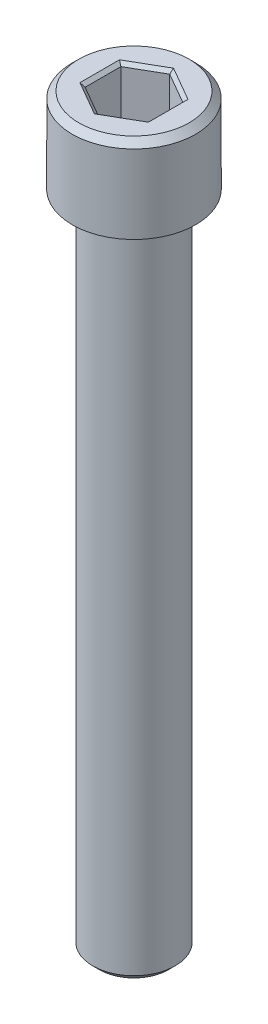
ISO-10303-21;
HEADER;
FILE_DESCRIPTION(('STEP AP214'),'2;1');
FILE_NAME('part.step','',(''),(''),'','','');
FILE_SCHEMA(('AUTOMOTIVE_DESIGN { 1 0 10303 214 1 1 1 1 }'));
ENDSEC;
DATA;
#1=APPLICATION_CONTEXT('core data for automotive mechanical design processes');
#2=APPLICATION_PROTOCOL_DEFINITION('international standard','automotive_design',2000,#1);
#3=PRODUCT_CONTEXT('',#1,'mechanical');
#4=PRODUCT('Part','Part','',(#3));
#5=PRODUCT_RELATED_PRODUCT_CATEGORY('part','',(#4));
#6=PRODUCT_DEFINITION_FORMATION('','',#4);
#7=PRODUCT_DEFINITION_CONTEXT('part definition',#1,'design');
#8=PRODUCT_DEFINITION('design','',#6,#7);
#9=PRODUCT_DEFINITION_SHAPE('','',#8);
#10=(LENGTH_UNIT() NAMED_UNIT(*) SI_UNIT(.MILLI.,.METRE.));
#11=(NAMED_UNIT(*) PLANE_ANGLE_UNIT() SI_UNIT($,.RADIAN.));
#12=(NAMED_UNIT(*) SI_UNIT($,.STERADIAN.) SOLID_ANGLE_UNIT());
#13=UNCERTAINTY_MEASURE_WITH_UNIT(LENGTH_MEASURE(1.E-05),#10,'distance_accuracy_value','');
#14=(GEOMETRIC_REPRESENTATION_CONTEXT(3) GLOBAL_UNCERTAINTY_ASSIGNED_CONTEXT((#13)) GLOBAL_UNIT_ASSIGNED_CONTEXT((#10,
#11,#12)) REPRESENTATION_CONTEXT('',''));
#15=CARTESIAN_POINT('',(0.,0.,0.));
#16=DIRECTION('',(0.,0.,1.));
#17=DIRECTION('',(1.,0.,0.));
#18=AXIS2_PLACEMENT_3D('',#15,#16,#17);
#19=CARTESIAN_POINT('',(-4.77519999999997,-4.57200000000002,0.));
#20=DIRECTION('',(0.,-1.,0.));
#21=DIRECTION('',(0.,0.,-1.));
#22=AXIS2_PLACEMENT_3D('',#19,#20,#21);
#23=PLANE('',#22);
#24=DIRECTION('',(-0.866025403784438,0.,0.5));
#25=VECTOR('',#24,1.);
#26=CARTESIAN_POINT('',(2.3876,-4.57200000000002,1.37848150271715));
#27=LINE('',#26,#25);
#28=CARTESIAN_POINT('',(2.3876,-4.57200000000002,1.37848150271715));
#29=VERTEX_POINT('',#28);
#30=CARTESIAN_POINT('',(0.,-4.57200000000002,2.7569630054343));
#31=VERTEX_POINT('',#30);
#32=EDGE_CURVE('E85',#29,#31,#27,.T.);
#33=ORIENTED_EDGE('',*,*,#32,.F.);
#34=DIRECTION('',(0.,0.,1.));
#35=VECTOR('',#34,1.);
#36=CARTESIAN_POINT('',(2.3876,-4.57200000000002,-1.37848150271715));
#37=LINE('',#36,#35);
#38=CARTESIAN_POINT('',(2.3876,-4.57200000000002,-1.37848150271715));
#39=VERTEX_POINT('',#38);
#40=EDGE_CURVE('E90',#39,#29,#37,.T.);
#41=ORIENTED_EDGE('',*,*,#40,.F.);
#42=DIRECTION('',(0.866025403784438,0.,0.5));
#43=VECTOR('',#42,1.);
#44=CARTESIAN_POINT('',(0.,-4.57200000000002,-2.75696300543429));
#45=LINE('',#44,#43);
#46=CARTESIAN_POINT('',(0.,-4.57200000000002,-2.75696300543429));
#47=VERTEX_POINT('',#46);
#48=EDGE_CURVE('E171',#47,#39,#45,.T.);
#49=ORIENTED_EDGE('',*,*,#48,.F.);
#50=DIRECTION('',(0.866025403784438,0.,-0.5));
#51=VECTOR('',#50,1.);
#52=CARTESIAN_POINT('',(-2.38759999999999,-4.57200000000002,-1.37848150271714));
#53=LINE('',#52,#51);
#54=CARTESIAN_POINT('',(-2.38759999999997,-4.57200000000002,-1.37848150271714));
#55=VERTEX_POINT('',#54);
#56=EDGE_CURVE('E177',#55,#47,#53,.T.);
#57=ORIENTED_EDGE('',*,*,#56,.F.);
#58=DIRECTION('',(0.,0.,-1.));
#59=VECTOR('',#58,1.);
#60=CARTESIAN_POINT('',(-2.38759999999996,-4.57200000000002,1.37848150271717));
#61=LINE('',#60,#59);
#62=CARTESIAN_POINT('',(-2.38759999999996,-4.57200000000002,1.37848150271717));
#63=VERTEX_POINT('',#62);
#64=EDGE_CURVE('E182',#63,#55,#61,.T.);
#65=ORIENTED_EDGE('',*,*,#64,.F.);
#66=DIRECTION('',(-0.866025403784438,0.,-0.500000000000001));
#67=VECTOR('',#66,1.);
#68=CARTESIAN_POINT('',(0.,-4.57200000000002,2.75696300543431));
#69=LINE('',#68,#67);
#70=EDGE_CURVE('E101',#31,#63,#69,.T.);
#71=ORIENTED_EDGE('',*,*,#70,.F.);
#72=EDGE_LOOP('',(#33,#41,#49,#57,#65,#71));
#73=FACE_BOUND('',#72,.T.);
#74=ADVANCED_FACE('F16',(#73),#23,.F.);
#75=CARTESIAN_POINT('',(2.3876,-4.57200000000002,-1.37848150271715));
#76=DIRECTION('',(-1.,0.,0.));
#77=DIRECTION('',(0.,0.,1.));
#78=AXIS2_PLACEMENT_3D('',#75,#76,#77);
#79=PLANE('',#78);
#80=DIRECTION('',(0.,1.,0.));
#81=VECTOR('',#80,1.);
#82=CARTESIAN_POINT('',(2.3876,-4.57200000000002,-1.37848150271715));
#83=LINE('',#82,#81);
#84=CARTESIAN_POINT('',(2.38760000000001,-0.253999999999981,-1.37848150271715));
#85=VERTEX_POINT('',#84);
#86=EDGE_CURVE('E95',#39,#85,#83,.T.);
#87=ORIENTED_EDGE('',*,*,#86,.F.);
#88=ORIENTED_EDGE('',*,*,#40,.T.);
#89=DIRECTION('',(0.,1.,0.));
#90=VECTOR('',#89,1.);
#91=CARTESIAN_POINT('',(2.3876,-4.57200000000002,1.37848150271715));
#92=LINE('',#91,#90);
#93=CARTESIAN_POINT('',(2.38760000000001,-0.25399999999998,1.37848150271715));
#94=VERTEX_POINT('',#93);
#95=EDGE_CURVE('E92',#94,#29,#92,.F.);
#96=ORIENTED_EDGE('',*,*,#95,.F.);
#97=DIRECTION('',(0.,0.,1.));
#98=VECTOR('',#97,1.);
#99=CARTESIAN_POINT('',(2.38760000000002,-0.25399999999999,0.));
#100=LINE('',#99,#98);
#101=EDGE_CURVE('E169',#94,#85,#100,.F.);
#102=ORIENTED_EDGE('',*,*,#101,.T.);
#103=EDGE_LOOP('',(#87,#88,#96,#102));
#104=FACE_BOUND('',#103,.T.);
#105=ADVANCED_FACE('F91',(#104),#79,.T.);
#106=CARTESIAN_POINT('',(2.3876,-4.57200000000002,1.37848150271715));
#107=DIRECTION('',(-0.5,0.,-0.866025403784438));
#108=DIRECTION('',(-0.866025403784438,0.,0.5));
#109=AXIS2_PLACEMENT_3D('',#106,#107,#108);
#110=PLANE('',#109);
#111=ORIENTED_EDGE('',*,*,#95,.T.);
#112=ORIENTED_EDGE('',*,*,#32,.T.);
#113=DIRECTION('',(0.,1.,0.));
#114=VECTOR('',#113,1.);
#115=CARTESIAN_POINT('',(0.,-4.57200000000002,2.75696300543431));
#116=LINE('',#115,#114);
#117=CARTESIAN_POINT('',(0.,-0.253999999999979,2.75696300543431));
#118=VERTEX_POINT('',#117);
#119=EDGE_CURVE('E103',#118,#31,#116,.F.);
#120=ORIENTED_EDGE('',*,*,#119,.F.);
#121=DIRECTION('',(0.866025403784438,0.,-0.500000000000001));
#122=VECTOR('',#121,1.);
#123=CARTESIAN_POINT('',(0.,-0.253999999999987,2.75696300543432));
#124=LINE('',#123,#122);
#125=EDGE_CURVE('E107',#118,#94,#124,.T.);
#126=ORIENTED_EDGE('',*,*,#125,.T.);
#127=EDGE_LOOP('',(#111,#112,#120,#126));
#128=FACE_BOUND('',#127,.T.);
#129=ADVANCED_FACE('F105',(#128),#110,.T.);
#130=CARTESIAN_POINT('',(0.,-4.57200000000002,2.75696300543431));
#131=DIRECTION('',(0.500000000000001,0.,-0.866025403784438));
#132=DIRECTION('',(-0.866025403784438,0.,-0.500000000000001));
#133=AXIS2_PLACEMENT_3D('',#130,#131,#132);
#134=PLANE('',#133);
#135=ORIENTED_EDGE('',*,*,#119,.T.);
#136=ORIENTED_EDGE('',*,*,#70,.T.);
#137=DIRECTION('',(0.,1.,0.));
#138=VECTOR('',#137,1.);
#139=CARTESIAN_POINT('',(-2.38759999999996,-4.57200000000002,1.37848150271717));
#140=LINE('',#139,#138);
#141=CARTESIAN_POINT('',(-2.38759999999997,-0.253999999999979,1.37848150271717));
#142=VERTEX_POINT('',#141);
#143=EDGE_CURVE('E184',#142,#63,#140,.F.);
#144=ORIENTED_EDGE('',*,*,#143,.F.);
#145=DIRECTION('',(0.866025403784438,0.,0.500000000000002));
#146=VECTOR('',#145,1.);
#147=CARTESIAN_POINT('',(-2.38759999999997,-0.253999999999992,1.37848150271718));
#148=LINE('',#147,#146);
#149=EDGE_CURVE('E163',#142,#118,#148,.T.);
#150=ORIENTED_EDGE('',*,*,#149,.T.);
#151=EDGE_LOOP('',(#135,#136,#144,#150));
#152=FACE_BOUND('',#151,.T.);
#153=ADVANCED_FACE('F188',(#152),#134,.T.);
#154=CARTESIAN_POINT('',(-2.38759999999996,-4.57200000000002,1.37848150271717));
#155=DIRECTION('',(1.,0.,0.));
#156=DIRECTION('',(0.,0.,-1.));
#157=AXIS2_PLACEMENT_3D('',#154,#155,#156);
#158=PLANE('',#157);
#159=ORIENTED_EDGE('',*,*,#143,.T.);
#160=ORIENTED_EDGE('',*,*,#64,.T.);
#161=DIRECTION('',(0.,1.,0.));
#162=VECTOR('',#161,1.);
#163=CARTESIAN_POINT('',(-2.38759999999999,-4.57200000000002,-1.37848150271714));
#164=LINE('',#163,#162);
#165=CARTESIAN_POINT('',(-2.38759999999998,-0.253999999999979,-1.37848150271714));
#166=VERTEX_POINT('',#165);
#167=EDGE_CURVE('E179',#166,#55,#164,.F.);
#168=ORIENTED_EDGE('',*,*,#167,.F.);
#169=DIRECTION('',(0.,0.,1.));
#170=VECTOR('',#169,1.);
#171=CARTESIAN_POINT('',(-2.3876,-0.253999999999983,0.));
#172=LINE('',#171,#170);
#173=EDGE_CURVE('E158',#166,#142,#172,.T.);
#174=ORIENTED_EDGE('',*,*,#173,.T.);
#175=EDGE_LOOP('',(#159,#160,#168,#174));
#176=FACE_BOUND('',#175,.T.);
#177=ADVANCED_FACE('F218',(#176),#158,.T.);
#178=CARTESIAN_POINT('',(-2.38759999999999,-4.57200000000002,-1.37848150271714));
#179=DIRECTION('',(0.5,0.,0.866025403784438));
#180=DIRECTION('',(0.866025403784438,0.,-0.5));
#181=AXIS2_PLACEMENT_3D('',#178,#179,#180);
#182=PLANE('',#181);
#183=ORIENTED_EDGE('',*,*,#167,.T.);
#184=ORIENTED_EDGE('',*,*,#56,.T.);
#185=DIRECTION('',(0.,1.,0.));
#186=VECTOR('',#185,1.);
#187=CARTESIAN_POINT('',(0.,-4.57200000000002,-2.75696300543429));
#188=LINE('',#187,#186);
#189=CARTESIAN_POINT('',(0.,-0.253999999999979,-2.7569630054343));
#190=VERTEX_POINT('',#189);
#191=EDGE_CURVE('E173',#190,#47,#188,.F.);
#192=ORIENTED_EDGE('',*,*,#191,.F.);
#193=DIRECTION('',(-0.866025403784438,0.,0.5));
#194=VECTOR('',#193,1.);
#195=CARTESIAN_POINT('',(0.,-0.253999999999991,-2.75696300543431));
#196=LINE('',#195,#194);
#197=EDGE_CURVE('E153',#190,#166,#196,.T.);
#198=ORIENTED_EDGE('',*,*,#197,.T.);
#199=EDGE_LOOP('',(#183,#184,#192,#198));
#200=FACE_BOUND('',#199,.T.);
#201=ADVANCED_FACE('F214',(#200),#182,.T.);
#202=CARTESIAN_POINT('',(0.,-4.57200000000002,-2.75696300543429));
#203=DIRECTION('',(-0.5,0.,0.866025403784438));
#204=DIRECTION('',(0.866025403784438,0.,0.5));
#205=AXIS2_PLACEMENT_3D('',#202,#203,#204);
#206=PLANE('',#205);
#207=ORIENTED_EDGE('',*,*,#191,.T.);
#208=ORIENTED_EDGE('',*,*,#48,.T.);
#209=ORIENTED_EDGE('',*,*,#86,.T.);
#210=DIRECTION('',(-0.866025403784438,0.,-0.5));
#211=VECTOR('',#210,1.);
#212=CARTESIAN_POINT('',(2.38760000000001,-0.253999999999982,-1.37848150271715));
#213=LINE('',#212,#211);
#214=EDGE_CURVE('E145',#85,#190,#213,.T.);
#215=ORIENTED_EDGE('',*,*,#214,.T.);
#216=EDGE_LOOP('',(#207,#208,#209,#215));
#217=FACE_BOUND('',#216,.T.);
#218=ADVANCED_FACE('F209',(#217),#206,.T.);
#219=CARTESIAN_POINT('',(2.64160000000001,0.,0.));
#220=DIRECTION('',(0.707106781186548,-0.707106781186547,0.));
#221=DIRECTION('',(0.707106781186547,0.707106781186548,0.));
#222=AXIS2_PLACEMENT_3D('',#219,#220,#221);
#223=PLANE('',#222);
#224=ORIENTED_EDGE('',*,*,#101,.F.);
#225=DIRECTION('',(0.654653670707951,0.654653670707987,0.377964473009256));
#226=VECTOR('',#225,1.);
#227=CARTESIAN_POINT('',(2.38760000000001,-0.253999999999991,1.37848150271716));
#228=LINE('',#227,#226);
#229=CARTESIAN_POINT('',(2.64160000000001,0.,1.52512847109134));
#230=VERTEX_POINT('',#229);
#231=EDGE_CURVE('E166',#94,#230,#228,.T.);
#232=ORIENTED_EDGE('',*,*,#231,.T.);
#233=DIRECTION('',(0.,0.,1.));
#234=VECTOR('',#233,1.);
#235=CARTESIAN_POINT('',(2.64160000000001,0.,0.));
#236=LINE('',#235,#234);
#237=CARTESIAN_POINT('',(2.64160000000001,0.,-1.52512847109129));
#238=VERTEX_POINT('',#237);
#239=EDGE_CURVE('E141',#238,#230,#236,.T.);
#240=ORIENTED_EDGE('',*,*,#239,.F.);
#241=DIRECTION('',(-0.654653670708017,-0.654653670707961,0.377964473009186));
#242=VECTOR('',#241,1.);
#243=CARTESIAN_POINT('',(2.64160000000001,0.,-1.52512847109129));
#244=LINE('',#243,#242);
#245=EDGE_CURVE('E148',#238,#85,#244,.T.);
#246=ORIENTED_EDGE('',*,*,#245,.T.);
#247=EDGE_LOOP('',(#224,#232,#240,#246));
#248=FACE_BOUND('',#247,.T.);
#249=ADVANCED_FACE('F204',(#248),#223,.F.);
#250=CARTESIAN_POINT('',(1.3208,0.,2.28769270663698));
#251=DIRECTION('',(0.353553390593274,-0.707106781186548,0.612372435695794));
#252=DIRECTION('',(0.,-0.654653670707976,-0.755928946018455));
#253=AXIS2_PLACEMENT_3D('',#250,#251,#252);
#254=PLANE('',#253);
#255=ORIENTED_EDGE('',*,*,#125,.F.);
#256=DIRECTION('',(0.,-0.654653670707977,-0.755928946018455));
#257=VECTOR('',#256,1.);
#258=CARTESIAN_POINT('',(0.,-0.377371428571426,2.61450595044226));
#259=LINE('',#258,#257);
#260=CARTESIAN_POINT('',(0.,0.,3.05025694218264));
#261=VERTEX_POINT('',#260);
#262=EDGE_CURVE('E161',#118,#261,#259,.F.);
#263=ORIENTED_EDGE('',*,*,#262,.T.);
#264=DIRECTION('',(-0.866025403784443,0.,0.499999999999993));
#265=VECTOR('',#264,1.);
#266=CARTESIAN_POINT('',(2.64160000000001,0.,1.52512847109135));
#267=LINE('',#266,#265);
#268=EDGE_CURVE('E138',#230,#261,#267,.T.);
#269=ORIENTED_EDGE('',*,*,#268,.F.);
#270=ORIENTED_EDGE('',*,*,#231,.F.);
#271=EDGE_LOOP('',(#255,#263,#269,#270));
#272=FACE_BOUND('',#271,.T.);
#273=ADVANCED_FACE('F195',(#272),#254,.F.);
#274=CARTESIAN_POINT('',(-1.3208,0.,2.28769270663698));
#275=DIRECTION('',(-0.353553390593274,-0.707106781186548,0.612372435695794));
#276=DIRECTION('',(0.,-0.654653670707977,-0.755928946018455));
#277=AXIS2_PLACEMENT_3D('',#274,#275,#276);
#278=PLANE('',#277);
#279=DIRECTION('',(-0.866025403784436,0.,-0.500000000000004));
#280=VECTOR('',#279,1.);
#281=CARTESIAN_POINT('',(0.,0.,3.05025694218264));
#282=LINE('',#281,#280);
#283=CARTESIAN_POINT('',(-2.64159999999998,0.,1.52512847109132));
#284=VERTEX_POINT('',#283);
#285=EDGE_CURVE('E135',#261,#284,#282,.T.);
#286=ORIENTED_EDGE('',*,*,#285,.F.);
#287=ORIENTED_EDGE('',*,*,#262,.F.);
#288=ORIENTED_EDGE('',*,*,#149,.F.);
#289=DIRECTION('',(-0.654653670707984,0.654653670707984,0.377964473009202));
#290=VECTOR('',#289,1.);
#291=CARTESIAN_POINT('',(-2.38759999999998,-0.253999999999997,1.37848150271717));
#292=LINE('',#291,#290);
#293=EDGE_CURVE('E156',#142,#284,#292,.T.);
#294=ORIENTED_EDGE('',*,*,#293,.T.);
#295=EDGE_LOOP('',(#286,#287,#288,#294));
#296=FACE_BOUND('',#295,.T.);
#297=ADVANCED_FACE('F198',(#296),#278,.F.);
#298=CARTESIAN_POINT('',(-2.64159999999998,0.,0.));
#299=DIRECTION('',(-0.707106781186548,-0.707106781186547,0.));
#300=DIRECTION('',(0.707106781186547,-0.707106781186548,0.));
#301=AXIS2_PLACEMENT_3D('',#298,#299,#300);
#302=PLANE('',#301);
#303=DIRECTION('',(0.,0.,1.));
#304=VECTOR('',#303,1.);
#305=CARTESIAN_POINT('',(-2.64159999999998,0.,0.));
#306=LINE('',#305,#304);
#307=CARTESIAN_POINT('',(-2.64159999999998,0.,-1.52512847109131));
#308=VERTEX_POINT('',#307);
#309=EDGE_CURVE('E132',#284,#308,#306,.F.);
#310=ORIENTED_EDGE('',*,*,#309,.F.);
#311=ORIENTED_EDGE('',*,*,#293,.F.);
#312=ORIENTED_EDGE('',*,*,#173,.F.);
#313=DIRECTION('',(-0.654653670707983,0.654653670707975,-0.377964473009221));
#314=VECTOR('',#313,1.);
#315=CARTESIAN_POINT('',(-2.3876,-0.253999999999991,-1.37848150271715));
#316=LINE('',#315,#314);
#317=EDGE_CURVE('E151',#166,#308,#316,.T.);
#318=ORIENTED_EDGE('',*,*,#317,.T.);
#319=EDGE_LOOP('',(#310,#311,#312,#318));
#320=FACE_BOUND('',#319,.T.);
#321=ADVANCED_FACE('F216',(#320),#302,.F.);
#322=CARTESIAN_POINT('',(-1.3208,0.,-2.28769270663697));
#323=DIRECTION('',(-0.353553390593274,-0.707106781186547,-0.612372435695795));
#324=DIRECTION('',(0.,0.654653670707977,-0.755928946018454));
#325=AXIS2_PLACEMENT_3D('',#322,#323,#324);
#326=PLANE('',#325);
#327=ORIENTED_EDGE('',*,*,#197,.F.);
#328=DIRECTION('',(0.,0.654653670707977,-0.755928946018455));
#329=VECTOR('',#328,1.);
#330=CARTESIAN_POINT('',(0.,-0.377371428571423,-2.61450595044224));
#331=LINE('',#330,#329);
#332=CARTESIAN_POINT('',(0.,0.,-3.05025694218262));
#333=VERTEX_POINT('',#332);
#334=EDGE_CURVE('E34',#190,#333,#331,.T.);
#335=ORIENTED_EDGE('',*,*,#334,.T.);
#336=DIRECTION('',(0.86602540378444,0.,-0.499999999999998));
#337=VECTOR('',#336,1.);
#338=CARTESIAN_POINT('',(-2.64159999999999,0.,-1.52512847109131));
#339=LINE('',#338,#337);
#340=EDGE_CURVE('E129',#308,#333,#339,.T.);
#341=ORIENTED_EDGE('',*,*,#340,.F.);
#342=ORIENTED_EDGE('',*,*,#317,.F.);
#343=EDGE_LOOP('',(#327,#335,#341,#342));
#344=FACE_BOUND('',#343,.T.);
#345=ADVANCED_FACE('F211',(#344),#326,.F.);
#346=CARTESIAN_POINT('',(1.3208,0.,-2.28769270663696));
#347=DIRECTION('',(0.353553390593274,-0.707106781186548,-0.612372435695794));
#348=DIRECTION('',(0.,0.654653670707977,-0.755928946018455));
#349=AXIS2_PLACEMENT_3D('',#346,#347,#348);
#350=PLANE('',#349);
#351=ORIENTED_EDGE('',*,*,#214,.F.);
#352=ORIENTED_EDGE('',*,*,#245,.F.);
#353=DIRECTION('',(0.866025403784436,0.,0.500000000000005));
#354=VECTOR('',#353,1.);
#355=CARTESIAN_POINT('',(0.,0.,-3.05025694218262));
#356=LINE('',#355,#354);
#357=EDGE_CURVE('E124',#333,#238,#356,.T.);
#358=ORIENTED_EDGE('',*,*,#357,.F.);
#359=ORIENTED_EDGE('',*,*,#334,.F.);
#360=EDGE_LOOP('',(#351,#352,#358,#359));
#361=FACE_BOUND('',#360,.T.);
#362=ADVANCED_FACE('F207',(#361),#350,.F.);
#363=CARTESIAN_POINT('',(0.,0.,0.));
#364=DIRECTION('',(0.,1.,0.));
#365=DIRECTION('',(0.,0.,1.));
#366=AXIS2_PLACEMENT_3D('',#363,#364,#365);
#367=PLANE('',#366);
#368=CARTESIAN_POINT('',(0.,0.,0.));
#369=DIRECTION('',(0.,-1.,0.));
#370=DIRECTION('',(0.,0.,-1.));
#371=AXIS2_PLACEMENT_3D('',#368,#369,#370);
#372=CIRCLE('',#371,4.25450000005867);
#373=CARTESIAN_POINT('',(0.,0.,-4.25450000005867));
#374=VERTEX_POINT('',#373);
#375=EDGE_CURVE('E19',#374,#374,#372,.T.);
#376=ORIENTED_EDGE('',*,*,#375,.F.);
#377=EDGE_LOOP('',(#376));
#378=FACE_BOUND('',#377,.T.);
#379=ORIENTED_EDGE('',*,*,#340,.T.);
#380=ORIENTED_EDGE('',*,*,#357,.T.);
#381=ORIENTED_EDGE('',*,*,#239,.T.);
#382=ORIENTED_EDGE('',*,*,#268,.T.);
#383=ORIENTED_EDGE('',*,*,#285,.T.);
#384=ORIENTED_EDGE('',*,*,#309,.T.);
#385=EDGE_LOOP('',(#379,#380,#381,#382,#383,#384));
#386=FACE_BOUND('',#385,.T.);
#387=ADVANCED_FACE('F201',(#378,#386),#367,.T.);
#388=CARTESIAN_POINT('',(0.,-0.507999999911135,0.));
#389=DIRECTION('',(0.,-1.,0.));
#390=DIRECTION('',(0.,0.,-1.));
#391=AXIS2_PLACEMENT_3D('',#388,#389,#390);
#392=CONICAL_SURFACE('',#391,4.76250000002665,0.785398163453397);
#393=CARTESIAN_POINT('',(0.,-0.507999999999953,0.));
#394=DIRECTION('',(0.,1.,0.));
#395=DIRECTION('',(0.,0.,1.));
#396=AXIS2_PLACEMENT_3D('',#393,#394,#395);
#397=CIRCLE('',#396,4.7625);
#398=CARTESIAN_POINT('',(0.,-0.507999999999953,4.7625));
#399=VERTEX_POINT('',#398);
#400=EDGE_CURVE('E116',#399,#399,#397,.F.);
#401=ORIENTED_EDGE('',*,*,#400,.F.);
#402=EDGE_LOOP('',(#401));
#403=FACE_BOUND('',#402,.T.);
#404=ORIENTED_EDGE('',*,*,#375,.T.);
#405=EDGE_LOOP('',(#404));
#406=FACE_BOUND('',#405,.T.);
#407=ADVANCED_FACE('F251',(#403,#406),#392,.T.);
#408=CARTESIAN_POINT('',(0.,-57.3531999999999,0.));
#409=DIRECTION('',(0.,1.,0.));
#410=DIRECTION('',(0.,0.,1.));
#411=AXIS2_PLACEMENT_3D('',#408,#409,#410);
#412=PLANE('',#411);
#413=CARTESIAN_POINT('',(0.,-57.3532000000228,0.));
#414=DIRECTION('',(0.,1.,0.));
#415=DIRECTION('',(-1.,0.,0.));
#416=AXIS2_PLACEMENT_3D('',#413,#414,#415);
#417=CIRCLE('',#416,2.66699999991715);
#418=CARTESIAN_POINT('',(-2.66699999991715,-57.3532000000228,0.));
#419=VERTEX_POINT('',#418);
#420=EDGE_CURVE('E114',#419,#419,#417,.T.);
#421=ORIENTED_EDGE('',*,*,#420,.F.);
#422=EDGE_LOOP('',(#421));
#423=FACE_BOUND('',#422,.T.);
#424=ADVANCED_FACE('F248',(#423),#412,.F.);
#425=CARTESIAN_POINT('',(0.,-6.55319999999992,0.));
#426=DIRECTION('',(0.,1.,0.));
#427=DIRECTION('',(0.,0.,1.));
#428=AXIS2_PLACEMENT_3D('',#425,#426,#427);
#429=CYLINDRICAL_SURFACE('',#428,4.7625);
#430=ORIENTED_EDGE('',*,*,#400,.T.);
#431=EDGE_LOOP('',(#430));
#432=FACE_BOUND('',#431,.T.);
#433=CARTESIAN_POINT('',(0.,-6.55319999999992,0.));
#434=DIRECTION('',(0.,1.,0.));
#435=DIRECTION('',(0.,0.,1.));
#436=AXIS2_PLACEMENT_3D('',#433,#434,#435);
#437=CIRCLE('',#436,4.7625);
#438=CARTESIAN_POINT('',(0.,-6.55319999999992,4.7625));
#439=VERTEX_POINT('',#438);
#440=EDGE_CURVE('E112',#439,#439,#437,.T.);
#441=ORIENTED_EDGE('',*,*,#440,.T.);
#442=EDGE_LOOP('',(#441));
#443=FACE_BOUND('',#442,.T.);
#444=ADVANCED_FACE('F244',(#432,#443),#429,.T.);
#445=CARTESIAN_POINT('',(0.,-56.8451999999411,0.));
#446=DIRECTION('',(0.,1.,0.));
#447=DIRECTION('',(-1.,0.,0.));
#448=AXIS2_PLACEMENT_3D('',#445,#446,#447);
#449=CONICAL_SURFACE('',#448,3.17499999999882,0.785398163397448);
#450=CARTESIAN_POINT('',(0.,-56.8451999999999,0.));
#451=DIRECTION('',(0.,1.,0.));
#452=DIRECTION('',(0.,0.,1.));
#453=AXIS2_PLACEMENT_3D('',#450,#451,#452);
#454=CIRCLE('',#453,3.175);
#455=CARTESIAN_POINT('',(0.,-56.8451999999999,3.175));
#456=VERTEX_POINT('',#455);
#457=EDGE_CURVE('E25',#456,#456,#454,.T.);
#458=ORIENTED_EDGE('',*,*,#457,.F.);
#459=EDGE_LOOP('',(#458));
#460=FACE_BOUND('',#459,.T.);
#461=ORIENTED_EDGE('',*,*,#420,.T.);
#462=EDGE_LOOP('',(#461));
#463=FACE_BOUND('',#462,.T.);
#464=ADVANCED_FACE('F237',(#460,#463),#449,.T.);
#465=CARTESIAN_POINT('',(0.,-6.55319999999992,0.));
#466=DIRECTION('',(0.,1.,0.));
#467=DIRECTION('',(0.,0.,1.));
#468=AXIS2_PLACEMENT_3D('',#465,#466,#467);
#469=PLANE('',#468);
#470=ORIENTED_EDGE('',*,*,#440,.F.);
#471=EDGE_LOOP('',(#470));
#472=FACE_BOUND('',#471,.T.);
#473=CARTESIAN_POINT('',(0.,-6.55319999999993,0.));
#474=DIRECTION('',(0.,1.,0.));
#475=DIRECTION('',(0.,0.,1.));
#476=AXIS2_PLACEMENT_3D('',#473,#474,#475);
#477=CIRCLE('',#476,3.175);
#478=CARTESIAN_POINT('',(0.,-6.55319999999993,3.175));
#479=VERTEX_POINT('',#478);
#480=EDGE_CURVE('E11',#479,#479,#477,.F.);
#481=ORIENTED_EDGE('',*,*,#480,.F.);
#482=EDGE_LOOP('',(#481));
#483=FACE_BOUND('',#482,.T.);
#484=ADVANCED_FACE('F231',(#472,#483),#469,.F.);
#485=CARTESIAN_POINT('',(0.,-57.3531999999999,0.));
#486=DIRECTION('',(0.,1.,0.));
#487=DIRECTION('',(0.,0.,1.));
#488=AXIS2_PLACEMENT_3D('',#485,#486,#487);
#489=CYLINDRICAL_SURFACE('',#488,3.175);
#490=ORIENTED_EDGE('',*,*,#480,.T.);
#491=EDGE_LOOP('',(#490));
#492=FACE_BOUND('',#491,.T.);
#493=ORIENTED_EDGE('',*,*,#457,.T.);
#494=EDGE_LOOP('',(#493));
#495=FACE_BOUND('',#494,.T.);
#496=ADVANCED_FACE('F229',(#492,#495),#489,.T.);
#497=CLOSED_SHELL('',(#74,#105,#129,#153,#177,#201,#218,#249,#273,#297,#321,#345,#362,#387,#407,
#424,#444,#464,#484,#496));
#498=MANIFOLD_SOLID_BREP('B1',#497);
#499=ADVANCED_BREP_SHAPE_REPRESENTATION('',(#18,#498),#14);
#500=SHAPE_DEFINITION_REPRESENTATION(#9,#499);
ENDSEC;
END-ISO-10303-21;
